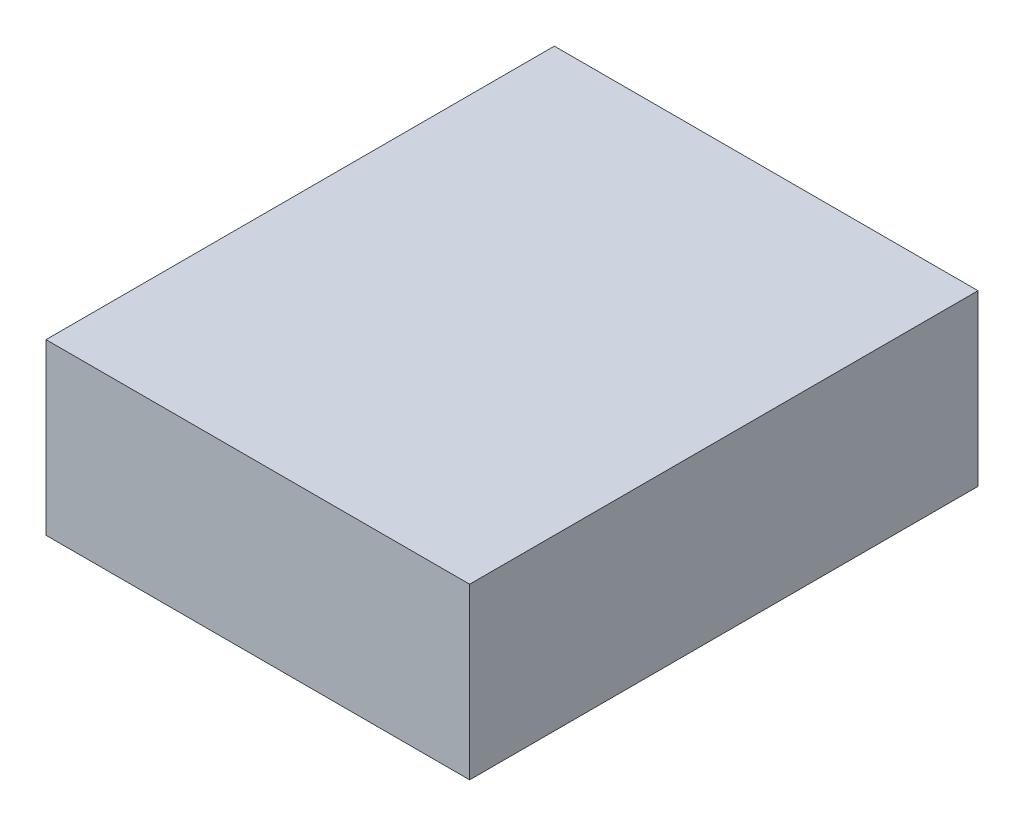
ISO-10303-21;
HEADER;
FILE_DESCRIPTION(('STEP AP214'),'2;1');
FILE_NAME('part.step','',(''),(''),'','','');
FILE_SCHEMA(('AUTOMOTIVE_DESIGN { 1 0 10303 214 1 1 1 1 }'));
ENDSEC;
DATA;
#1=APPLICATION_CONTEXT('core data for automotive mechanical design processes');
#2=APPLICATION_PROTOCOL_DEFINITION('international standard','automotive_design',2000,#1);
#3=PRODUCT_CONTEXT('',#1,'mechanical');
#4=PRODUCT('Part','Part','',(#3));
#5=PRODUCT_RELATED_PRODUCT_CATEGORY('part','',(#4));
#6=PRODUCT_DEFINITION_FORMATION('','',#4);
#7=PRODUCT_DEFINITION_CONTEXT('part definition',#1,'design');
#8=PRODUCT_DEFINITION('design','',#6,#7);
#9=PRODUCT_DEFINITION_SHAPE('','',#8);
#10=(LENGTH_UNIT() NAMED_UNIT(*) SI_UNIT(.MILLI.,.METRE.));
#11=(NAMED_UNIT(*) PLANE_ANGLE_UNIT() SI_UNIT($,.RADIAN.));
#12=(NAMED_UNIT(*) SI_UNIT($,.STERADIAN.) SOLID_ANGLE_UNIT());
#13=UNCERTAINTY_MEASURE_WITH_UNIT(LENGTH_MEASURE(1.E-05),#10,'distance_accuracy_value','');
#14=(GEOMETRIC_REPRESENTATION_CONTEXT(3) GLOBAL_UNCERTAINTY_ASSIGNED_CONTEXT((#13)) GLOBAL_UNIT_ASSIGNED_CONTEXT((#10,
#11,#12)) REPRESENTATION_CONTEXT('',''));
#15=CARTESIAN_POINT('',(0.,0.,0.));
#16=DIRECTION('',(0.,0.,1.));
#17=DIRECTION('',(1.,0.,0.));
#18=AXIS2_PLACEMENT_3D('',#15,#16,#17);
#19=CARTESIAN_POINT('',(-2.5,2.,3.));
#20=DIRECTION('',(1.,0.,0.));
#21=DIRECTION('',(0.,0.,-1.));
#22=AXIS2_PLACEMENT_3D('',#19,#20,#21);
#23=PLANE('',#22);
#24=DIRECTION('',(0.,0.,1.));
#25=VECTOR('',#24,1.);
#26=CARTESIAN_POINT('',(-2.5,0.,3.));
#27=LINE('',#26,#25);
#28=CARTESIAN_POINT('',(-2.5,0.,-3.));
#29=VERTEX_POINT('',#28);
#30=CARTESIAN_POINT('',(-2.5,0.,3.));
#31=VERTEX_POINT('',#30);
#32=EDGE_CURVE('E95',#29,#31,#27,.T.);
#33=ORIENTED_EDGE('',*,*,#32,.T.);
#34=DIRECTION('',(0.,-1.,0.));
#35=VECTOR('',#34,1.);
#36=CARTESIAN_POINT('',(-2.5,2.,3.));
#37=LINE('',#36,#35);
#38=CARTESIAN_POINT('',(-2.5,2.,3.));
#39=VERTEX_POINT('',#38);
#40=EDGE_CURVE('E11',#39,#31,#37,.T.);
#41=ORIENTED_EDGE('',*,*,#40,.F.);
#42=DIRECTION('',(0.,0.,1.));
#43=VECTOR('',#42,1.);
#44=CARTESIAN_POINT('',(-2.5,2.,3.));
#45=LINE('',#44,#43);
#46=CARTESIAN_POINT('',(-2.5,2.,-3.));
#47=VERTEX_POINT('',#46);
#48=EDGE_CURVE('E83',#47,#39,#45,.T.);
#49=ORIENTED_EDGE('',*,*,#48,.F.);
#50=DIRECTION('',(0.,-1.,0.));
#51=VECTOR('',#50,1.);
#52=CARTESIAN_POINT('',(-2.5,2.,-3.));
#53=LINE('',#52,#51);
#54=EDGE_CURVE('E91',#47,#29,#53,.T.);
#55=ORIENTED_EDGE('',*,*,#54,.T.);
#56=EDGE_LOOP('',(#33,#41,#49,#55));
#57=FACE_BOUND('',#56,.T.);
#58=ADVANCED_FACE('F32',(#57),#23,.F.);
#59=CARTESIAN_POINT('',(2.5,2.,3.));
#60=DIRECTION('',(0.,0.,-1.));
#61=DIRECTION('',(-1.,0.,0.));
#62=AXIS2_PLACEMENT_3D('',#59,#60,#61);
#63=PLANE('',#62);
#64=DIRECTION('',(1.,0.,0.));
#65=VECTOR('',#64,1.);
#66=CARTESIAN_POINT('',(2.5,0.,3.));
#67=LINE('',#66,#65);
#68=CARTESIAN_POINT('',(2.5,0.,3.));
#69=VERTEX_POINT('',#68);
#70=EDGE_CURVE('E87',#31,#69,#67,.T.);
#71=ORIENTED_EDGE('',*,*,#70,.T.);
#72=DIRECTION('',(0.,-1.,0.));
#73=VECTOR('',#72,1.);
#74=CARTESIAN_POINT('',(2.5,2.,3.));
#75=LINE('',#74,#73);
#76=CARTESIAN_POINT('',(2.5,2.,3.));
#77=VERTEX_POINT('',#76);
#78=EDGE_CURVE('E40',#77,#69,#75,.T.);
#79=ORIENTED_EDGE('',*,*,#78,.F.);
#80=DIRECTION('',(1.,0.,0.));
#81=VECTOR('',#80,1.);
#82=CARTESIAN_POINT('',(2.5,2.,3.));
#83=LINE('',#82,#81);
#84=EDGE_CURVE('E78',#39,#77,#83,.T.);
#85=ORIENTED_EDGE('',*,*,#84,.F.);
#86=ORIENTED_EDGE('',*,*,#40,.T.);
#87=EDGE_LOOP('',(#71,#79,#85,#86));
#88=FACE_BOUND('',#87,.T.);
#89=ADVANCED_FACE('F86',(#88),#63,.F.);
#90=CARTESIAN_POINT('',(2.5,2.,3.));
#91=DIRECTION('',(-1.,0.,0.));
#92=DIRECTION('',(0.,0.,1.));
#93=AXIS2_PLACEMENT_3D('',#90,#91,#92);
#94=PLANE('',#93);
#95=DIRECTION('',(0.,0.,-1.));
#96=VECTOR('',#95,1.);
#97=CARTESIAN_POINT('',(2.5,0.,3.));
#98=LINE('',#97,#96);
#99=CARTESIAN_POINT('',(2.5,0.,-3.));
#100=VERTEX_POINT('',#99);
#101=EDGE_CURVE('E65',#69,#100,#98,.T.);
#102=ORIENTED_EDGE('',*,*,#101,.T.);
#103=DIRECTION('',(0.,-1.,0.));
#104=VECTOR('',#103,1.);
#105=CARTESIAN_POINT('',(2.5,2.,-3.));
#106=LINE('',#105,#104);
#107=CARTESIAN_POINT('',(2.5,2.,-3.));
#108=VERTEX_POINT('',#107);
#109=EDGE_CURVE('E88',#108,#100,#106,.T.);
#110=ORIENTED_EDGE('',*,*,#109,.F.);
#111=DIRECTION('',(0.,0.,-1.));
#112=VECTOR('',#111,1.);
#113=CARTESIAN_POINT('',(2.5,2.,3.));
#114=LINE('',#113,#112);
#115=EDGE_CURVE('E81',#77,#108,#114,.T.);
#116=ORIENTED_EDGE('',*,*,#115,.F.);
#117=ORIENTED_EDGE('',*,*,#78,.T.);
#118=EDGE_LOOP('',(#102,#110,#116,#117));
#119=FACE_BOUND('',#118,.T.);
#120=ADVANCED_FACE('F89',(#119),#94,.F.);
#121=CARTESIAN_POINT('',(2.5,2.,-3.));
#122=DIRECTION('',(0.,0.,1.));
#123=DIRECTION('',(1.,0.,0.));
#124=AXIS2_PLACEMENT_3D('',#121,#122,#123);
#125=PLANE('',#124);
#126=DIRECTION('',(-1.,0.,0.));
#127=VECTOR('',#126,1.);
#128=CARTESIAN_POINT('',(2.5,0.,-3.));
#129=LINE('',#128,#127);
#130=EDGE_CURVE('E71',#100,#29,#129,.T.);
#131=ORIENTED_EDGE('',*,*,#130,.T.);
#132=ORIENTED_EDGE('',*,*,#54,.F.);
#133=DIRECTION('',(-1.,0.,0.));
#134=VECTOR('',#133,1.);
#135=CARTESIAN_POINT('',(2.5,2.,-3.));
#136=LINE('',#135,#134);
#137=EDGE_CURVE('E48',#108,#47,#136,.T.);
#138=ORIENTED_EDGE('',*,*,#137,.F.);
#139=ORIENTED_EDGE('',*,*,#109,.T.);
#140=EDGE_LOOP('',(#131,#132,#138,#139));
#141=FACE_BOUND('',#140,.T.);
#142=ADVANCED_FACE('F102',(#141),#125,.F.);
#143=CARTESIAN_POINT('',(0.,2.,0.));
#144=DIRECTION('',(0.,1.,0.));
#145=DIRECTION('',(0.,0.,1.));
#146=AXIS2_PLACEMENT_3D('',#143,#144,#145);
#147=PLANE('',#146);
#148=ORIENTED_EDGE('',*,*,#48,.T.);
#149=ORIENTED_EDGE('',*,*,#84,.T.);
#150=ORIENTED_EDGE('',*,*,#115,.T.);
#151=ORIENTED_EDGE('',*,*,#137,.T.);
#152=EDGE_LOOP('',(#148,#149,#150,#151));
#153=FACE_BOUND('',#152,.T.);
#154=ADVANCED_FACE('F79',(#153),#147,.T.);
#155=CARTESIAN_POINT('',(0.,0.,0.));
#156=DIRECTION('',(0.,1.,0.));
#157=DIRECTION('',(0.,0.,1.));
#158=AXIS2_PLACEMENT_3D('',#155,#156,#157);
#159=PLANE('',#158);
#160=ORIENTED_EDGE('',*,*,#32,.F.);
#161=ORIENTED_EDGE('',*,*,#130,.F.);
#162=ORIENTED_EDGE('',*,*,#101,.F.);
#163=ORIENTED_EDGE('',*,*,#70,.F.);
#164=EDGE_LOOP('',(#160,#161,#162,#163));
#165=FACE_BOUND('',#164,.T.);
#166=ADVANCED_FACE('F105',(#165),#159,.F.);
#167=CLOSED_SHELL('',(#58,#89,#120,#142,#154,#166));
#168=MANIFOLD_SOLID_BREP('B2',#167);
#169=ADVANCED_BREP_SHAPE_REPRESENTATION('',(#18,#168),#14);
#170=SHAPE_DEFINITION_REPRESENTATION(#9,#169);
ENDSEC;
END-ISO-10303-21;
